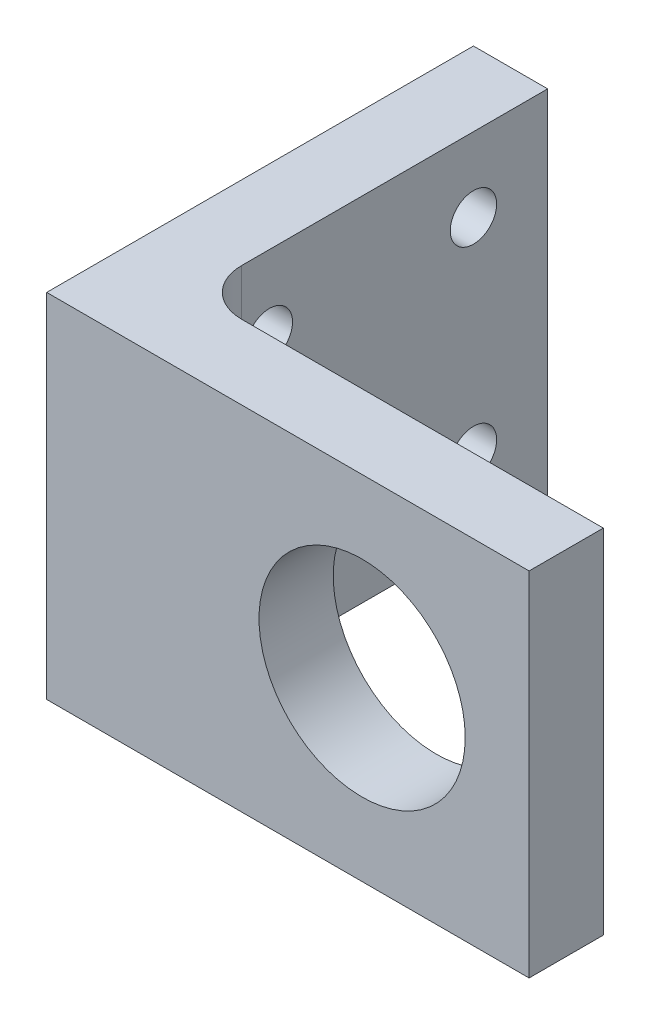
ISO-10303-21;
HEADER;
FILE_DESCRIPTION(('STEP AP214'),'2;1');
FILE_NAME('part.step','',(''),(''),'','','');
FILE_SCHEMA(('AUTOMOTIVE_DESIGN { 1 0 10303 214 1 1 1 1 }'));
ENDSEC;
DATA;
#1=APPLICATION_CONTEXT('core data for automotive mechanical design processes');
#2=APPLICATION_PROTOCOL_DEFINITION('international standard','automotive_design',2000,#1);
#3=PRODUCT_CONTEXT('',#1,'mechanical');
#4=PRODUCT('Part','Part','',(#3));
#5=PRODUCT_RELATED_PRODUCT_CATEGORY('part','',(#4));
#6=PRODUCT_DEFINITION_FORMATION('','',#4);
#7=PRODUCT_DEFINITION_CONTEXT('part definition',#1,'design');
#8=PRODUCT_DEFINITION('design','',#6,#7);
#9=PRODUCT_DEFINITION_SHAPE('','',#8);
#10=(LENGTH_UNIT() NAMED_UNIT(*) SI_UNIT(.MILLI.,.METRE.));
#11=(NAMED_UNIT(*) PLANE_ANGLE_UNIT() SI_UNIT($,.RADIAN.));
#12=(NAMED_UNIT(*) SI_UNIT($,.STERADIAN.) SOLID_ANGLE_UNIT());
#13=UNCERTAINTY_MEASURE_WITH_UNIT(LENGTH_MEASURE(1.E-05),#10,'distance_accuracy_value','');
#14=(GEOMETRIC_REPRESENTATION_CONTEXT(3) GLOBAL_UNCERTAINTY_ASSIGNED_CONTEXT((#13)) GLOBAL_UNIT_ASSIGNED_CONTEXT((#10,
#11,#12)) REPRESENTATION_CONTEXT('',''));
#15=CARTESIAN_POINT('',(0.,0.,0.));
#16=DIRECTION('',(0.,0.,1.));
#17=DIRECTION('',(1.,0.,0.));
#18=AXIS2_PLACEMENT_3D('',#15,#16,#17);
#19=CARTESIAN_POINT('',(13.,0.,-5.));
#20=DIRECTION('',(0.,1.,0.));
#21=DIRECTION('',(-1.,0.,0.));
#22=AXIS2_PLACEMENT_3D('',#19,#20,#21);
#23=CYLINDRICAL_SURFACE('',#22,5.);
#24=DIRECTION('',(0.,1.,0.));
#25=VECTOR('',#24,1.);
#26=CARTESIAN_POINT('',(13.,0.,0.));
#27=LINE('',#26,#25);
#28=CARTESIAN_POINT('',(13.,0.,0.));
#29=VERTEX_POINT('',#28);
#30=CARTESIAN_POINT('',(13.,38.,0.));
#31=VERTEX_POINT('',#30);
#32=EDGE_CURVE('E182',#29,#31,#27,.T.);
#33=ORIENTED_EDGE('',*,*,#32,.F.);
#34=CARTESIAN_POINT('',(13.,0.,-5.));
#35=DIRECTION('',(0.,1.,0.));
#36=DIRECTION('',(-1.,0.,0.));
#37=AXIS2_PLACEMENT_3D('',#34,#35,#36);
#38=CIRCLE('',#37,5.);
#39=CARTESIAN_POINT('',(7.99999999999999,0.,-5.));
#40=VERTEX_POINT('',#39);
#41=EDGE_CURVE('E59',#29,#40,#38,.F.);
#42=ORIENTED_EDGE('',*,*,#41,.T.);
#43=DIRECTION('',(0.,1.,0.));
#44=VECTOR('',#43,1.);
#45=CARTESIAN_POINT('',(7.99999999999999,0.,-5.));
#46=LINE('',#45,#44);
#47=CARTESIAN_POINT('',(8.,38.,-5.));
#48=VERTEX_POINT('',#47);
#49=EDGE_CURVE('E186',#48,#40,#46,.F.);
#50=ORIENTED_EDGE('',*,*,#49,.F.);
#51=CARTESIAN_POINT('',(13.,38.,-5.));
#52=DIRECTION('',(0.,-1.,0.));
#53=DIRECTION('',(1.,0.,0.));
#54=AXIS2_PLACEMENT_3D('',#51,#52,#53);
#55=CIRCLE('',#54,5.);
#56=EDGE_CURVE('E13',#48,#31,#55,.F.);
#57=ORIENTED_EDGE('',*,*,#56,.T.);
#58=EDGE_LOOP('',(#33,#42,#50,#57));
#59=FACE_BOUND('',#58,.T.);
#60=ADVANCED_FACE('F51',(#59),#23,.F.);
#61=CARTESIAN_POINT('',(0.,0.,8.));
#62=DIRECTION('',(0.,0.,-1.));
#63=DIRECTION('',(-1.,0.,0.));
#64=AXIS2_PLACEMENT_3D('',#61,#62,#63);
#65=PLANE('',#64);
#66=DIRECTION('',(0.,-1.,0.));
#67=VECTOR('',#66,1.);
#68=CARTESIAN_POINT('',(0.,0.,8.));
#69=LINE('',#68,#67);
#70=CARTESIAN_POINT('',(0.,38.,8.));
#71=VERTEX_POINT('',#70);
#72=CARTESIAN_POINT('',(0.,0.,8.));
#73=VERTEX_POINT('',#72);
#74=EDGE_CURVE('E147',#71,#73,#69,.T.);
#75=ORIENTED_EDGE('',*,*,#74,.T.);
#76=DIRECTION('',(1.,0.,0.));
#77=VECTOR('',#76,1.);
#78=CARTESIAN_POINT('',(0.,0.,8.));
#79=LINE('',#78,#77);
#80=CARTESIAN_POINT('',(52.,0.,8.));
#81=VERTEX_POINT('',#80);
#82=EDGE_CURVE('E151',#73,#81,#79,.T.);
#83=ORIENTED_EDGE('',*,*,#82,.T.);
#84=DIRECTION('',(0.,1.,0.));
#85=VECTOR('',#84,1.);
#86=CARTESIAN_POINT('',(52.,0.,8.));
#87=LINE('',#86,#85);
#88=CARTESIAN_POINT('',(52.,38.,8.));
#89=VERTEX_POINT('',#88);
#90=EDGE_CURVE('E155',#81,#89,#87,.T.);
#91=ORIENTED_EDGE('',*,*,#90,.T.);
#92=DIRECTION('',(-1.,0.,0.));
#93=VECTOR('',#92,1.);
#94=CARTESIAN_POINT('',(0.,38.,8.));
#95=LINE('',#94,#93);
#96=EDGE_CURVE('E158',#89,#71,#95,.T.);
#97=ORIENTED_EDGE('',*,*,#96,.T.);
#98=EDGE_LOOP('',(#75,#83,#91,#97));
#99=FACE_BOUND('',#98,.T.);
#100=CARTESIAN_POINT('',(34.,19.,8.));
#101=DIRECTION('',(0.,0.,1.));
#102=DIRECTION('',(1.,0.,0.));
#103=AXIS2_PLACEMENT_3D('',#100,#101,#102);
#104=CIRCLE('',#103,11.1125);
#105=CARTESIAN_POINT('',(45.1125,19.,8.));
#106=VERTEX_POINT('',#105);
#107=EDGE_CURVE('E138',#106,#106,#104,.T.);
#108=ORIENTED_EDGE('',*,*,#107,.F.);
#109=EDGE_LOOP('',(#108));
#110=FACE_BOUND('',#109,.T.);
#111=ADVANCED_FACE('F261',(#99,#110),#65,.F.);
#112=CARTESIAN_POINT('',(0.,0.,0.));
#113=DIRECTION('',(0.,0.,-1.));
#114=DIRECTION('',(-1.,0.,0.));
#115=AXIS2_PLACEMENT_3D('',#112,#113,#114);
#116=PLANE('',#115);
#117=DIRECTION('',(1.,0.,0.));
#118=VECTOR('',#117,1.);
#119=CARTESIAN_POINT('',(0.,0.,0.));
#120=LINE('',#119,#118);
#121=CARTESIAN_POINT('',(52.,0.,0.));
#122=VERTEX_POINT('',#121);
#123=EDGE_CURVE('E145',#29,#122,#120,.T.);
#124=ORIENTED_EDGE('',*,*,#123,.F.);
#125=ORIENTED_EDGE('',*,*,#32,.T.);
#126=DIRECTION('',(-1.,0.,0.));
#127=VECTOR('',#126,1.);
#128=CARTESIAN_POINT('',(0.,38.,0.));
#129=LINE('',#128,#127);
#130=CARTESIAN_POINT('',(52.,38.,0.));
#131=VERTEX_POINT('',#130);
#132=EDGE_CURVE('E152',#131,#31,#129,.T.);
#133=ORIENTED_EDGE('',*,*,#132,.F.);
#134=DIRECTION('',(0.,1.,0.));
#135=VECTOR('',#134,1.);
#136=CARTESIAN_POINT('',(52.,0.,0.));
#137=LINE('',#136,#135);
#138=EDGE_CURVE('E164',#122,#131,#137,.T.);
#139=ORIENTED_EDGE('',*,*,#138,.F.);
#140=EDGE_LOOP('',(#124,#125,#133,#139));
#141=FACE_BOUND('',#140,.T.);
#142=CARTESIAN_POINT('',(34.,19.,0.));
#143=DIRECTION('',(0.,0.,1.));
#144=DIRECTION('',(1.,0.,0.));
#145=AXIS2_PLACEMENT_3D('',#142,#143,#144);
#146=CIRCLE('',#145,11.1125);
#147=CARTESIAN_POINT('',(45.1125,19.,0.));
#148=VERTEX_POINT('',#147);
#149=EDGE_CURVE('E132',#148,#148,#146,.T.);
#150=ORIENTED_EDGE('',*,*,#149,.T.);
#151=EDGE_LOOP('',(#150));
#152=FACE_BOUND('',#151,.T.);
#153=ADVANCED_FACE('F270',(#141,#152),#116,.T.);
#154=CARTESIAN_POINT('',(0.,0.,8.));
#155=DIRECTION('',(1.,0.,0.));
#156=DIRECTION('',(0.,0.,-1.));
#157=AXIS2_PLACEMENT_3D('',#154,#155,#156);
#158=PLANE('',#157);
#159=CARTESIAN_POINT('',(0.,30.,-30.));
#160=DIRECTION('',(-1.,0.,0.));
#161=DIRECTION('',(0.,0.,-1.));
#162=AXIS2_PLACEMENT_3D('',#159,#160,#161);
#163=CIRCLE('',#162,2.5);
#164=CARTESIAN_POINT('',(0.,30.,-32.5));
#165=VERTEX_POINT('',#164);
#166=EDGE_CURVE('E219',#165,#165,#163,.T.);
#167=ORIENTED_EDGE('',*,*,#166,.F.);
#168=EDGE_LOOP('',(#167));
#169=FACE_BOUND('',#168,.T.);
#170=CARTESIAN_POINT('',(0.,8.,-8.));
#171=DIRECTION('',(-1.,0.,0.));
#172=DIRECTION('',(0.,0.,-1.));
#173=AXIS2_PLACEMENT_3D('',#170,#171,#172);
#174=CIRCLE('',#173,2.5);
#175=CARTESIAN_POINT('',(0.,8.,-10.5));
#176=VERTEX_POINT('',#175);
#177=EDGE_CURVE('E208',#176,#176,#174,.T.);
#178=ORIENTED_EDGE('',*,*,#177,.F.);
#179=EDGE_LOOP('',(#178));
#180=FACE_BOUND('',#179,.T.);
#181=CARTESIAN_POINT('',(0.,8.,-30.));
#182=DIRECTION('',(-1.,0.,0.));
#183=DIRECTION('',(0.,0.,1.));
#184=AXIS2_PLACEMENT_3D('',#181,#182,#183);
#185=CIRCLE('',#184,2.5);
#186=CARTESIAN_POINT('',(0.,8.,-27.5));
#187=VERTEX_POINT('',#186);
#188=EDGE_CURVE('E209',#187,#187,#185,.T.);
#189=ORIENTED_EDGE('',*,*,#188,.F.);
#190=EDGE_LOOP('',(#189));
#191=FACE_BOUND('',#190,.T.);
#192=CARTESIAN_POINT('',(0.,30.,-8.));
#193=DIRECTION('',(-1.,0.,0.));
#194=DIRECTION('',(0.,0.,1.));
#195=AXIS2_PLACEMENT_3D('',#192,#193,#194);
#196=CIRCLE('',#195,2.5);
#197=CARTESIAN_POINT('',(0.,30.,-5.5));
#198=VERTEX_POINT('',#197);
#199=EDGE_CURVE('E197',#198,#198,#196,.T.);
#200=ORIENTED_EDGE('',*,*,#199,.F.);
#201=EDGE_LOOP('',(#200));
#202=FACE_BOUND('',#201,.T.);
#203=DIRECTION('',(0.,0.,-1.));
#204=VECTOR('',#203,1.);
#205=CARTESIAN_POINT('',(0.,38.,8.));
#206=LINE('',#205,#204);
#207=CARTESIAN_POINT('',(0.,38.,-38.));
#208=VERTEX_POINT('',#207);
#209=EDGE_CURVE('E161',#71,#208,#206,.T.);
#210=ORIENTED_EDGE('',*,*,#209,.T.);
#211=DIRECTION('',(0.,1.,0.));
#212=VECTOR('',#211,1.);
#213=CARTESIAN_POINT('',(0.,0.,-38.));
#214=LINE('',#213,#212);
#215=CARTESIAN_POINT('',(0.,0.,-38.));
#216=VERTEX_POINT('',#215);
#217=EDGE_CURVE('E125',#216,#208,#214,.T.);
#218=ORIENTED_EDGE('',*,*,#217,.F.);
#219=DIRECTION('',(0.,0.,-1.));
#220=VECTOR('',#219,1.);
#221=CARTESIAN_POINT('',(0.,0.,8.));
#222=LINE('',#221,#220);
#223=EDGE_CURVE('E179',#73,#216,#222,.T.);
#224=ORIENTED_EDGE('',*,*,#223,.F.);
#225=ORIENTED_EDGE('',*,*,#74,.F.);
#226=EDGE_LOOP('',(#210,#218,#224,#225));
#227=FACE_BOUND('',#226,.T.);
#228=ADVANCED_FACE('F255',(#169,#180,#191,#202,#227),#158,.F.);
#229=CARTESIAN_POINT('',(0.,0.,8.));
#230=DIRECTION('',(0.,1.,0.));
#231=DIRECTION('',(-1.,0.,0.));
#232=AXIS2_PLACEMENT_3D('',#229,#230,#231);
#233=PLANE('',#232);
#234=ORIENTED_EDGE('',*,*,#41,.F.);
#235=ORIENTED_EDGE('',*,*,#123,.T.);
#236=DIRECTION('',(0.,0.,-1.));
#237=VECTOR('',#236,1.);
#238=CARTESIAN_POINT('',(52.,0.,8.));
#239=LINE('',#238,#237);
#240=EDGE_CURVE('E175',#81,#122,#239,.T.);
#241=ORIENTED_EDGE('',*,*,#240,.F.);
#242=ORIENTED_EDGE('',*,*,#82,.F.);
#243=ORIENTED_EDGE('',*,*,#223,.T.);
#244=DIRECTION('',(-1.,0.,0.));
#245=VECTOR('',#244,1.);
#246=CARTESIAN_POINT('',(0.,0.,-38.));
#247=LINE('',#246,#245);
#248=CARTESIAN_POINT('',(7.99999999999999,0.,-38.));
#249=VERTEX_POINT('',#248);
#250=EDGE_CURVE('E118',#249,#216,#247,.T.);
#251=ORIENTED_EDGE('',*,*,#250,.F.);
#252=DIRECTION('',(0.,0.,1.));
#253=VECTOR('',#252,1.);
#254=CARTESIAN_POINT('',(7.99999999999999,0.,-38.));
#255=LINE('',#254,#253);
#256=EDGE_CURVE('E113',#249,#40,#255,.T.);
#257=ORIENTED_EDGE('',*,*,#256,.T.);
#258=EDGE_LOOP('',(#234,#235,#241,#242,#243,#251,#257));
#259=FACE_BOUND('',#258,.T.);
#260=ADVANCED_FACE('F272',(#259),#233,.F.);
#261=CARTESIAN_POINT('',(52.,0.,8.));
#262=DIRECTION('',(-1.,0.,0.));
#263=DIRECTION('',(0.,0.,1.));
#264=AXIS2_PLACEMENT_3D('',#261,#262,#263);
#265=PLANE('',#264);
#266=ORIENTED_EDGE('',*,*,#138,.T.);
#267=DIRECTION('',(0.,0.,-1.));
#268=VECTOR('',#267,1.);
#269=CARTESIAN_POINT('',(52.,38.,8.));
#270=LINE('',#269,#268);
#271=EDGE_CURVE('E171',#89,#131,#270,.T.);
#272=ORIENTED_EDGE('',*,*,#271,.F.);
#273=ORIENTED_EDGE('',*,*,#90,.F.);
#274=ORIENTED_EDGE('',*,*,#240,.T.);
#275=EDGE_LOOP('',(#266,#272,#273,#274));
#276=FACE_BOUND('',#275,.T.);
#277=ADVANCED_FACE('F266',(#276),#265,.F.);
#278=CARTESIAN_POINT('',(0.,38.,8.));
#279=DIRECTION('',(0.,-1.,0.));
#280=DIRECTION('',(1.,0.,0.));
#281=AXIS2_PLACEMENT_3D('',#278,#279,#280);
#282=PLANE('',#281);
#283=ORIENTED_EDGE('',*,*,#132,.T.);
#284=ORIENTED_EDGE('',*,*,#56,.F.);
#285=DIRECTION('',(0.,0.,1.));
#286=VECTOR('',#285,1.);
#287=CARTESIAN_POINT('',(8.,38.,-38.));
#288=LINE('',#287,#286);
#289=CARTESIAN_POINT('',(8.,38.,-38.));
#290=VERTEX_POINT('',#289);
#291=EDGE_CURVE('E111',#290,#48,#288,.T.);
#292=ORIENTED_EDGE('',*,*,#291,.F.);
#293=DIRECTION('',(1.,0.,0.));
#294=VECTOR('',#293,1.);
#295=CARTESIAN_POINT('',(0.,38.,-38.));
#296=LINE('',#295,#294);
#297=EDGE_CURVE('E119',#208,#290,#296,.T.);
#298=ORIENTED_EDGE('',*,*,#297,.F.);
#299=ORIENTED_EDGE('',*,*,#209,.F.);
#300=ORIENTED_EDGE('',*,*,#96,.F.);
#301=ORIENTED_EDGE('',*,*,#271,.T.);
#302=EDGE_LOOP('',(#283,#284,#292,#298,#299,#300,#301));
#303=FACE_BOUND('',#302,.T.);
#304=ADVANCED_FACE('F130',(#303),#282,.F.);
#305=CARTESIAN_POINT('',(34.,19.,8.));
#306=DIRECTION('',(0.,0.,-1.));
#307=DIRECTION('',(-1.,0.,0.));
#308=AXIS2_PLACEMENT_3D('',#305,#306,#307);
#309=CYLINDRICAL_SURFACE('',#308,11.1125);
#310=ORIENTED_EDGE('',*,*,#107,.T.);
#311=EDGE_LOOP('',(#310));
#312=FACE_BOUND('',#311,.T.);
#313=ORIENTED_EDGE('',*,*,#149,.F.);
#314=EDGE_LOOP('',(#313));
#315=FACE_BOUND('',#314,.T.);
#316=ADVANCED_FACE('F291',(#312,#315),#309,.F.);
#317=CARTESIAN_POINT('',(7.99999999999999,0.,-38.));
#318=DIRECTION('',(-1.,0.,0.));
#319=DIRECTION('',(0.,-1.,0.));
#320=AXIS2_PLACEMENT_3D('',#317,#318,#319);
#321=PLANE('',#320);
#322=CARTESIAN_POINT('',(8.,30.,-30.));
#323=DIRECTION('',(-1.,0.,0.));
#324=DIRECTION('',(0.,0.,-1.));
#325=AXIS2_PLACEMENT_3D('',#322,#323,#324);
#326=CIRCLE('',#325,2.5);
#327=CARTESIAN_POINT('',(8.,30.,-32.5));
#328=VERTEX_POINT('',#327);
#329=EDGE_CURVE('E202',#328,#328,#326,.T.);
#330=ORIENTED_EDGE('',*,*,#329,.T.);
#331=EDGE_LOOP('',(#330));
#332=FACE_BOUND('',#331,.T.);
#333=CARTESIAN_POINT('',(8.,8.,-8.));
#334=DIRECTION('',(-1.,0.,0.));
#335=DIRECTION('',(0.,0.,-1.));
#336=AXIS2_PLACEMENT_3D('',#333,#334,#335);
#337=CIRCLE('',#336,2.5);
#338=CARTESIAN_POINT('',(8.,8.,-10.5));
#339=VERTEX_POINT('',#338);
#340=EDGE_CURVE('E215',#339,#339,#337,.T.);
#341=ORIENTED_EDGE('',*,*,#340,.T.);
#342=EDGE_LOOP('',(#341));
#343=FACE_BOUND('',#342,.T.);
#344=CARTESIAN_POINT('',(8.,8.,-30.));
#345=DIRECTION('',(-1.,0.,0.));
#346=DIRECTION('',(0.,0.,1.));
#347=AXIS2_PLACEMENT_3D('',#344,#345,#346);
#348=CIRCLE('',#347,2.5);
#349=CARTESIAN_POINT('',(8.,8.,-27.5));
#350=VERTEX_POINT('',#349);
#351=EDGE_CURVE('E204',#350,#350,#348,.T.);
#352=ORIENTED_EDGE('',*,*,#351,.T.);
#353=EDGE_LOOP('',(#352));
#354=FACE_BOUND('',#353,.T.);
#355=CARTESIAN_POINT('',(8.,30.,-8.));
#356=DIRECTION('',(-1.,0.,0.));
#357=DIRECTION('',(0.,0.,1.));
#358=AXIS2_PLACEMENT_3D('',#355,#356,#357);
#359=CIRCLE('',#358,2.5);
#360=CARTESIAN_POINT('',(8.,30.,-5.5));
#361=VERTEX_POINT('',#360);
#362=EDGE_CURVE('E128',#361,#361,#359,.T.);
#363=ORIENTED_EDGE('',*,*,#362,.T.);
#364=EDGE_LOOP('',(#363));
#365=FACE_BOUND('',#364,.T.);
#366=ORIENTED_EDGE('',*,*,#291,.T.);
#367=ORIENTED_EDGE('',*,*,#49,.T.);
#368=ORIENTED_EDGE('',*,*,#256,.F.);
#369=DIRECTION('',(0.,-1.,0.));
#370=VECTOR('',#369,1.);
#371=CARTESIAN_POINT('',(7.99999999999999,0.,-38.));
#372=LINE('',#371,#370);
#373=EDGE_CURVE('E108',#290,#249,#372,.T.);
#374=ORIENTED_EDGE('',*,*,#373,.F.);
#375=EDGE_LOOP('',(#366,#367,#368,#374));
#376=FACE_BOUND('',#375,.T.);
#377=ADVANCED_FACE('F110',(#332,#343,#354,#365,#376),#321,.F.);
#378=CARTESIAN_POINT('',(0.,0.,-38.));
#379=DIRECTION('',(0.,0.,-1.));
#380=DIRECTION('',(-1.,0.,0.));
#381=AXIS2_PLACEMENT_3D('',#378,#379,#380);
#382=PLANE('',#381);
#383=ORIENTED_EDGE('',*,*,#297,.T.);
#384=ORIENTED_EDGE('',*,*,#373,.T.);
#385=ORIENTED_EDGE('',*,*,#250,.T.);
#386=ORIENTED_EDGE('',*,*,#217,.T.);
#387=EDGE_LOOP('',(#383,#384,#385,#386));
#388=FACE_BOUND('',#387,.T.);
#389=ADVANCED_FACE('F123',(#388),#382,.T.);
#390=CARTESIAN_POINT('',(8.,30.,-8.));
#391=DIRECTION('',(-1.,0.,0.));
#392=DIRECTION('',(0.,0.,1.));
#393=AXIS2_PLACEMENT_3D('',#390,#391,#392);
#394=CYLINDRICAL_SURFACE('',#393,2.5);
#395=ORIENTED_EDGE('',*,*,#362,.F.);
#396=EDGE_LOOP('',(#395));
#397=FACE_BOUND('',#396,.T.);
#398=ORIENTED_EDGE('',*,*,#199,.T.);
#399=EDGE_LOOP('',(#398));
#400=FACE_BOUND('',#399,.T.);
#401=ADVANCED_FACE('F309',(#397,#400),#394,.F.);
#402=CARTESIAN_POINT('',(8.,8.,-30.));
#403=DIRECTION('',(-1.,0.,0.));
#404=DIRECTION('',(0.,0.,1.));
#405=AXIS2_PLACEMENT_3D('',#402,#403,#404);
#406=CYLINDRICAL_SURFACE('',#405,2.5);
#407=ORIENTED_EDGE('',*,*,#351,.F.);
#408=EDGE_LOOP('',(#407));
#409=FACE_BOUND('',#408,.T.);
#410=ORIENTED_EDGE('',*,*,#188,.T.);
#411=EDGE_LOOP('',(#410));
#412=FACE_BOUND('',#411,.T.);
#413=ADVANCED_FACE('F315',(#409,#412),#406,.F.);
#414=CARTESIAN_POINT('',(8.,8.,-8.));
#415=DIRECTION('',(-1.,0.,0.));
#416=DIRECTION('',(0.,0.,1.));
#417=AXIS2_PLACEMENT_3D('',#414,#415,#416);
#418=CYLINDRICAL_SURFACE('',#417,2.5);
#419=ORIENTED_EDGE('',*,*,#340,.F.);
#420=EDGE_LOOP('',(#419));
#421=FACE_BOUND('',#420,.T.);
#422=ORIENTED_EDGE('',*,*,#177,.T.);
#423=EDGE_LOOP('',(#422));
#424=FACE_BOUND('',#423,.T.);
#425=ADVANCED_FACE('F317',(#421,#424),#418,.F.);
#426=CARTESIAN_POINT('',(8.,30.,-30.));
#427=DIRECTION('',(-1.,0.,0.));
#428=DIRECTION('',(0.,0.,1.));
#429=AXIS2_PLACEMENT_3D('',#426,#427,#428);
#430=CYLINDRICAL_SURFACE('',#429,2.5);
#431=ORIENTED_EDGE('',*,*,#329,.F.);
#432=EDGE_LOOP('',(#431));
#433=FACE_BOUND('',#432,.T.);
#434=ORIENTED_EDGE('',*,*,#166,.T.);
#435=EDGE_LOOP('',(#434));
#436=FACE_BOUND('',#435,.T.);
#437=ADVANCED_FACE('F320',(#433,#436),#430,.F.);
#438=CLOSED_SHELL('',(#60,#111,#153,#228,#260,#277,#304,#316,#377,#389,#401,#413,#425,#437));
#439=MANIFOLD_SOLID_BREP('B2',#438);
#440=ADVANCED_BREP_SHAPE_REPRESENTATION('',(#18,#439),#14);
#441=SHAPE_DEFINITION_REPRESENTATION(#9,#440);
ENDSEC;
END-ISO-10303-21;
